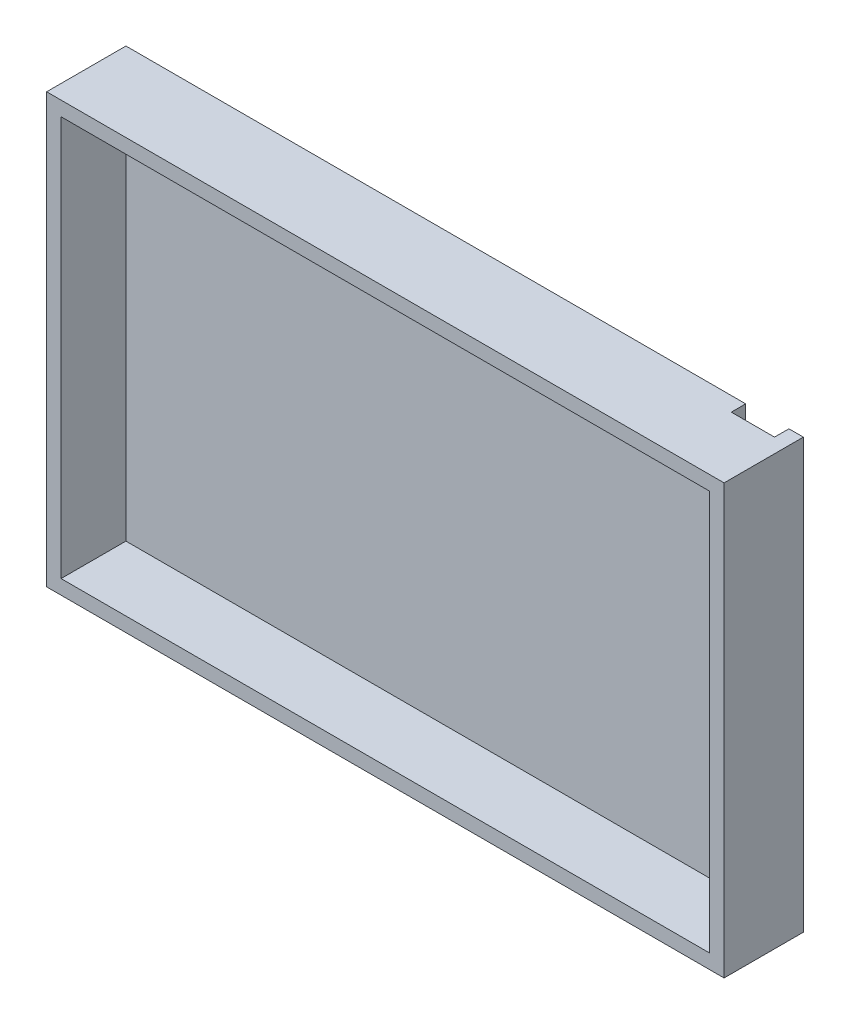
ISO-10303-21;
HEADER;
FILE_DESCRIPTION(('STEP AP214'),'2;1');
FILE_NAME('part.step','',(''),(''),'','','');
FILE_SCHEMA(('AUTOMOTIVE_DESIGN { 1 0 10303 214 1 1 1 1 }'));
ENDSEC;
DATA;
#1=APPLICATION_CONTEXT('core data for automotive mechanical design processes');
#2=APPLICATION_PROTOCOL_DEFINITION('international standard','automotive_design',2000,#1);
#3=PRODUCT_CONTEXT('',#1,'mechanical');
#4=PRODUCT('Part','Part','',(#3));
#5=PRODUCT_RELATED_PRODUCT_CATEGORY('part','',(#4));
#6=PRODUCT_DEFINITION_FORMATION('','',#4);
#7=PRODUCT_DEFINITION_CONTEXT('part definition',#1,'design');
#8=PRODUCT_DEFINITION('design','',#6,#7);
#9=PRODUCT_DEFINITION_SHAPE('','',#8);
#10=(LENGTH_UNIT() NAMED_UNIT(*) SI_UNIT(.MILLI.,.METRE.));
#11=(NAMED_UNIT(*) PLANE_ANGLE_UNIT() SI_UNIT($,.RADIAN.));
#12=(NAMED_UNIT(*) SI_UNIT($,.STERADIAN.) SOLID_ANGLE_UNIT());
#13=UNCERTAINTY_MEASURE_WITH_UNIT(LENGTH_MEASURE(1.E-05),#10,'distance_accuracy_value','');
#14=(GEOMETRIC_REPRESENTATION_CONTEXT(3) GLOBAL_UNCERTAINTY_ASSIGNED_CONTEXT((#13)) GLOBAL_UNIT_ASSIGNED_CONTEXT((#10,
#11,#12)) REPRESENTATION_CONTEXT('',''));
#15=CARTESIAN_POINT('',(0.,0.,0.));
#16=DIRECTION('',(0.,0.,1.));
#17=DIRECTION('',(1.,0.,0.));
#18=AXIS2_PLACEMENT_3D('',#15,#16,#17);
#19=CARTESIAN_POINT('',(0.,0.,2.));
#20=DIRECTION('',(0.,0.,1.));
#21=DIRECTION('',(1.,0.,0.));
#22=AXIS2_PLACEMENT_3D('',#19,#20,#21);
#23=PLANE('',#22);
#24=DIRECTION('',(1.,0.,0.));
#25=VECTOR('',#24,1.);
#26=CARTESIAN_POINT('',(-45.,-27.75,2.));
#27=LINE('',#26,#25);
#28=CARTESIAN_POINT('',(-45.,-27.75,2.));
#29=VERTEX_POINT('',#28);
#30=CARTESIAN_POINT('',(39.,-27.75,2.));
#31=VERTEX_POINT('',#30);
#32=EDGE_CURVE('E183',#29,#31,#27,.T.);
#33=ORIENTED_EDGE('',*,*,#32,.T.);
#34=DIRECTION('',(0.,1.,0.));
#35=VECTOR('',#34,1.);
#36=CARTESIAN_POINT('',(39.,29.75,2.));
#37=LINE('',#36,#35);
#38=CARTESIAN_POINT('',(39.,27.75,2.));
#39=VERTEX_POINT('',#38);
#40=EDGE_CURVE('E171',#31,#39,#37,.T.);
#41=ORIENTED_EDGE('',*,*,#40,.T.);
#42=DIRECTION('',(-1.,0.,0.));
#43=VECTOR('',#42,1.);
#44=CARTESIAN_POINT('',(-45.,27.75,2.));
#45=LINE('',#44,#43);
#46=CARTESIAN_POINT('',(-45.,27.75,2.));
#47=VERTEX_POINT('',#46);
#48=EDGE_CURVE('E179',#39,#47,#45,.T.);
#49=ORIENTED_EDGE('',*,*,#48,.T.);
#50=DIRECTION('',(0.,-1.,0.));
#51=VECTOR('',#50,1.);
#52=CARTESIAN_POINT('',(-45.,27.75,2.));
#53=LINE('',#52,#51);
#54=EDGE_CURVE('E178',#47,#29,#53,.T.);
#55=ORIENTED_EDGE('',*,*,#54,.T.);
#56=EDGE_LOOP('',(#33,#41,#49,#55));
#57=FACE_BOUND('',#56,.T.);
#58=ADVANCED_FACE('F45',(#57),#23,.T.);
#59=CARTESIAN_POINT('',(0.,0.,0.));
#60=DIRECTION('',(0.,0.,1.));
#61=DIRECTION('',(1.,0.,0.));
#62=AXIS2_PLACEMENT_3D('',#59,#60,#61);
#63=PLANE('',#62);
#64=DIRECTION('',(-1.,0.,0.));
#65=VECTOR('',#64,1.);
#66=CARTESIAN_POINT('',(-47.,29.75,0.));
#67=LINE('',#66,#65);
#68=CARTESIAN_POINT('',(39.,29.75,0.));
#69=VERTEX_POINT('',#68);
#70=CARTESIAN_POINT('',(-47.,29.75,0.));
#71=VERTEX_POINT('',#70);
#72=EDGE_CURVE('E233',#69,#71,#67,.T.);
#73=ORIENTED_EDGE('',*,*,#72,.F.);
#74=DIRECTION('',(0.,1.,0.));
#75=VECTOR('',#74,1.);
#76=CARTESIAN_POINT('',(39.,29.75,0.));
#77=LINE('',#76,#75);
#78=CARTESIAN_POINT('',(39.,-29.75,0.));
#79=VERTEX_POINT('',#78);
#80=EDGE_CURVE('E156',#79,#69,#77,.T.);
#81=ORIENTED_EDGE('',*,*,#80,.F.);
#82=DIRECTION('',(1.,0.,0.));
#83=VECTOR('',#82,1.);
#84=CARTESIAN_POINT('',(-47.,-29.75,0.));
#85=LINE('',#84,#83);
#86=CARTESIAN_POINT('',(-47.,-29.75,0.));
#87=VERTEX_POINT('',#86);
#88=EDGE_CURVE('E220',#87,#79,#85,.T.);
#89=ORIENTED_EDGE('',*,*,#88,.F.);
#90=DIRECTION('',(0.,-1.,0.));
#91=VECTOR('',#90,1.);
#92=CARTESIAN_POINT('',(-47.,29.75,0.));
#93=LINE('',#92,#91);
#94=EDGE_CURVE('E236',#71,#87,#93,.T.);
#95=ORIENTED_EDGE('',*,*,#94,.F.);
#96=EDGE_LOOP('',(#73,#81,#89,#95));
#97=FACE_BOUND('',#96,.T.);
#98=ADVANCED_FACE('F260',(#97),#63,.F.);
#99=CARTESIAN_POINT('',(47.,29.75,11.));
#100=DIRECTION('',(-1.,0.,0.));
#101=DIRECTION('',(0.,-1.,0.));
#102=AXIS2_PLACEMENT_3D('',#99,#100,#101);
#103=PLANE('',#102);
#104=DIRECTION('',(0.,1.,0.));
#105=VECTOR('',#104,1.);
#106=CARTESIAN_POINT('',(47.,29.75,0.));
#107=LINE('',#106,#105);
#108=CARTESIAN_POINT('',(47.,-29.75,0.));
#109=VERTEX_POINT('',#108);
#110=CARTESIAN_POINT('',(47.,29.75,0.));
#111=VERTEX_POINT('',#110);
#112=EDGE_CURVE('E206',#109,#111,#107,.T.);
#113=ORIENTED_EDGE('',*,*,#112,.T.);
#114=DIRECTION('',(0.,0.,-1.));
#115=VECTOR('',#114,1.);
#116=CARTESIAN_POINT('',(47.,29.75,11.));
#117=LINE('',#116,#115);
#118=CARTESIAN_POINT('',(47.,29.75,11.));
#119=VERTEX_POINT('',#118);
#120=EDGE_CURVE('E11',#119,#111,#117,.T.);
#121=ORIENTED_EDGE('',*,*,#120,.F.);
#122=DIRECTION('',(0.,1.,0.));
#123=VECTOR('',#122,1.);
#124=CARTESIAN_POINT('',(47.,29.75,11.));
#125=LINE('',#124,#123);
#126=CARTESIAN_POINT('',(47.,-29.75,11.));
#127=VERTEX_POINT('',#126);
#128=EDGE_CURVE('E215',#127,#119,#125,.T.);
#129=ORIENTED_EDGE('',*,*,#128,.F.);
#130=DIRECTION('',(0.,0.,-1.));
#131=VECTOR('',#130,1.);
#132=CARTESIAN_POINT('',(47.,-29.75,11.));
#133=LINE('',#132,#131);
#134=EDGE_CURVE('E229',#127,#109,#133,.T.);
#135=ORIENTED_EDGE('',*,*,#134,.T.);
#136=EDGE_LOOP('',(#113,#121,#129,#135));
#137=FACE_BOUND('',#136,.T.);
#138=ADVANCED_FACE('F47',(#137),#103,.F.);
#139=CARTESIAN_POINT('',(-47.,29.75,11.));
#140=DIRECTION('',(0.,-1.,0.));
#141=DIRECTION('',(0.,0.,-1.));
#142=AXIS2_PLACEMENT_3D('',#139,#140,#141);
#143=PLANE('',#142);
#144=DIRECTION('',(1.,0.,0.));
#145=VECTOR('',#144,1.);
#146=CARTESIAN_POINT('',(45.,29.75,2.));
#147=LINE('',#146,#145);
#148=CARTESIAN_POINT('',(39.,29.75,2.));
#149=VERTEX_POINT('',#148);
#150=CARTESIAN_POINT('',(45.,29.75,2.));
#151=VERTEX_POINT('',#150);
#152=EDGE_CURVE('E151',#149,#151,#147,.T.);
#153=ORIENTED_EDGE('',*,*,#152,.F.);
#154=DIRECTION('',(0.,0.,-1.));
#155=VECTOR('',#154,1.);
#156=CARTESIAN_POINT('',(39.,29.75,2.));
#157=LINE('',#156,#155);
#158=EDGE_CURVE('E285',#149,#69,#157,.T.);
#159=ORIENTED_EDGE('',*,*,#158,.T.);
#160=ORIENTED_EDGE('',*,*,#72,.T.);
#161=DIRECTION('',(0.,0.,-1.));
#162=VECTOR('',#161,1.);
#163=CARTESIAN_POINT('',(-47.,29.75,11.));
#164=LINE('',#163,#162);
#165=CARTESIAN_POINT('',(-47.,29.75,11.));
#166=VERTEX_POINT('',#165);
#167=EDGE_CURVE('E54',#166,#71,#164,.T.);
#168=ORIENTED_EDGE('',*,*,#167,.F.);
#169=DIRECTION('',(-1.,0.,0.));
#170=VECTOR('',#169,1.);
#171=CARTESIAN_POINT('',(-47.,29.75,11.));
#172=LINE('',#171,#170);
#173=EDGE_CURVE('E219',#119,#166,#172,.T.);
#174=ORIENTED_EDGE('',*,*,#173,.F.);
#175=ORIENTED_EDGE('',*,*,#120,.T.);
#176=CARTESIAN_POINT('',(45.,29.75,0.));
#177=VERTEX_POINT('',#176);
#178=EDGE_CURVE('E160',#111,#177,#67,.T.);
#179=ORIENTED_EDGE('',*,*,#178,.T.);
#180=DIRECTION('',(0.,0.,-1.));
#181=VECTOR('',#180,1.);
#182=CARTESIAN_POINT('',(45.,29.75,2.));
#183=LINE('',#182,#181);
#184=EDGE_CURVE('E69',#151,#177,#183,.T.);
#185=ORIENTED_EDGE('',*,*,#184,.F.);
#186=EDGE_LOOP('',(#153,#159,#160,#168,#174,#175,#179,#185));
#187=FACE_BOUND('',#186,.T.);
#188=ADVANCED_FACE('F159',(#187),#143,.F.);
#189=CARTESIAN_POINT('',(-47.,29.75,11.));
#190=DIRECTION('',(1.,0.,0.));
#191=DIRECTION('',(0.,1.,0.));
#192=AXIS2_PLACEMENT_3D('',#189,#190,#191);
#193=PLANE('',#192);
#194=ORIENTED_EDGE('',*,*,#94,.T.);
#195=DIRECTION('',(0.,0.,-1.));
#196=VECTOR('',#195,1.);
#197=CARTESIAN_POINT('',(-47.,-29.75,11.));
#198=LINE('',#197,#196);
#199=CARTESIAN_POINT('',(-47.,-29.75,11.));
#200=VERTEX_POINT('',#199);
#201=EDGE_CURVE('E246',#200,#87,#198,.T.);
#202=ORIENTED_EDGE('',*,*,#201,.F.);
#203=DIRECTION('',(0.,-1.,0.));
#204=VECTOR('',#203,1.);
#205=CARTESIAN_POINT('',(-47.,29.75,11.));
#206=LINE('',#205,#204);
#207=EDGE_CURVE('E223',#166,#200,#206,.T.);
#208=ORIENTED_EDGE('',*,*,#207,.F.);
#209=ORIENTED_EDGE('',*,*,#167,.T.);
#210=EDGE_LOOP('',(#194,#202,#208,#209));
#211=FACE_BOUND('',#210,.T.);
#212=ADVANCED_FACE('F255',(#211),#193,.F.);
#213=CARTESIAN_POINT('',(-47.,-29.75,11.));
#214=DIRECTION('',(0.,1.,0.));
#215=DIRECTION('',(0.,0.,1.));
#216=AXIS2_PLACEMENT_3D('',#213,#214,#215);
#217=PLANE('',#216);
#218=ORIENTED_EDGE('',*,*,#88,.T.);
#219=DIRECTION('',(0.,0.,-1.));
#220=VECTOR('',#219,1.);
#221=CARTESIAN_POINT('',(39.,-29.75,2.));
#222=LINE('',#221,#220);
#223=CARTESIAN_POINT('',(39.,-29.75,2.));
#224=VERTEX_POINT('',#223);
#225=EDGE_CURVE('E168',#224,#79,#222,.T.);
#226=ORIENTED_EDGE('',*,*,#225,.F.);
#227=DIRECTION('',(-1.,0.,0.));
#228=VECTOR('',#227,1.);
#229=CARTESIAN_POINT('',(45.,-29.75,2.));
#230=LINE('',#229,#228);
#231=CARTESIAN_POINT('',(45.,-29.75,2.));
#232=VERTEX_POINT('',#231);
#233=EDGE_CURVE('E147',#232,#224,#230,.T.);
#234=ORIENTED_EDGE('',*,*,#233,.F.);
#235=DIRECTION('',(0.,0.,-1.));
#236=VECTOR('',#235,1.);
#237=CARTESIAN_POINT('',(45.,-29.75,2.));
#238=LINE('',#237,#236);
#239=CARTESIAN_POINT('',(45.,-29.75,0.));
#240=VERTEX_POINT('',#239);
#241=EDGE_CURVE('E162',#232,#240,#238,.T.);
#242=ORIENTED_EDGE('',*,*,#241,.T.);
#243=EDGE_CURVE('E239',#240,#109,#85,.T.);
#244=ORIENTED_EDGE('',*,*,#243,.T.);
#245=ORIENTED_EDGE('',*,*,#134,.F.);
#246=DIRECTION('',(1.,0.,0.));
#247=VECTOR('',#246,1.);
#248=CARTESIAN_POINT('',(-47.,-29.75,11.));
#249=LINE('',#248,#247);
#250=EDGE_CURVE('E226',#200,#127,#249,.T.);
#251=ORIENTED_EDGE('',*,*,#250,.F.);
#252=ORIENTED_EDGE('',*,*,#201,.T.);
#253=EDGE_LOOP('',(#218,#226,#234,#242,#244,#245,#251,#252));
#254=FACE_BOUND('',#253,.T.);
#255=ADVANCED_FACE('F264',(#254),#217,.F.);
#256=CARTESIAN_POINT('',(0.,0.,11.));
#257=DIRECTION('',(0.,0.,1.));
#258=DIRECTION('',(1.,0.,0.));
#259=AXIS2_PLACEMENT_3D('',#256,#257,#258);
#260=PLANE('',#259);
#261=DIRECTION('',(0.,1.,0.));
#262=VECTOR('',#261,1.);
#263=CARTESIAN_POINT('',(45.,27.75,11.));
#264=LINE('',#263,#262);
#265=CARTESIAN_POINT('',(45.,-27.75,11.));
#266=VERTEX_POINT('',#265);
#267=CARTESIAN_POINT('',(45.,27.75,11.));
#268=VERTEX_POINT('',#267);
#269=EDGE_CURVE('E188',#266,#268,#264,.T.);
#270=ORIENTED_EDGE('',*,*,#269,.F.);
#271=DIRECTION('',(1.,0.,0.));
#272=VECTOR('',#271,1.);
#273=CARTESIAN_POINT('',(-45.,-27.75,11.));
#274=LINE('',#273,#272);
#275=CARTESIAN_POINT('',(-45.,-27.75,11.));
#276=VERTEX_POINT('',#275);
#277=EDGE_CURVE('E199',#276,#266,#274,.T.);
#278=ORIENTED_EDGE('',*,*,#277,.F.);
#279=DIRECTION('',(0.,-1.,0.));
#280=VECTOR('',#279,1.);
#281=CARTESIAN_POINT('',(-45.,27.75,11.));
#282=LINE('',#281,#280);
#283=CARTESIAN_POINT('',(-45.,27.75,11.));
#284=VERTEX_POINT('',#283);
#285=EDGE_CURVE('E195',#284,#276,#282,.T.);
#286=ORIENTED_EDGE('',*,*,#285,.F.);
#287=DIRECTION('',(-1.,0.,0.));
#288=VECTOR('',#287,1.);
#289=CARTESIAN_POINT('',(-45.,27.75,11.));
#290=LINE('',#289,#288);
#291=EDGE_CURVE('E191',#268,#284,#290,.T.);
#292=ORIENTED_EDGE('',*,*,#291,.F.);
#293=EDGE_LOOP('',(#270,#278,#286,#292));
#294=FACE_BOUND('',#293,.T.);
#295=ORIENTED_EDGE('',*,*,#128,.T.);
#296=ORIENTED_EDGE('',*,*,#173,.T.);
#297=ORIENTED_EDGE('',*,*,#207,.T.);
#298=ORIENTED_EDGE('',*,*,#250,.T.);
#299=EDGE_LOOP('',(#295,#296,#297,#298));
#300=FACE_BOUND('',#299,.T.);
#301=ADVANCED_FACE('F270',(#294,#300),#260,.T.);
#302=ORIENTED_EDGE('',*,*,#243,.F.);
#303=DIRECTION('',(0.,-1.,0.));
#304=VECTOR('',#303,1.);
#305=CARTESIAN_POINT('',(45.,29.75,0.));
#306=LINE('',#305,#304);
#307=EDGE_CURVE('E277',#177,#240,#306,.T.);
#308=ORIENTED_EDGE('',*,*,#307,.F.);
#309=ORIENTED_EDGE('',*,*,#178,.F.);
#310=ORIENTED_EDGE('',*,*,#112,.F.);
#311=EDGE_LOOP('',(#302,#308,#309,#310));
#312=FACE_BOUND('',#311,.T.);
#313=ADVANCED_FACE('F276',(#312),#63,.F.);
#314=CARTESIAN_POINT('',(45.,27.75,2.));
#315=DIRECTION('',(1.,0.,0.));
#316=DIRECTION('',(0.,0.,-1.));
#317=AXIS2_PLACEMENT_3D('',#314,#315,#316);
#318=PLANE('',#317);
#319=ORIENTED_EDGE('',*,*,#269,.T.);
#320=DIRECTION('',(0.,0.,1.));
#321=VECTOR('',#320,1.);
#322=CARTESIAN_POINT('',(45.,27.75,2.));
#323=LINE('',#322,#321);
#324=CARTESIAN_POINT('',(45.,27.75,2.));
#325=VERTEX_POINT('',#324);
#326=EDGE_CURVE('E143',#325,#268,#323,.T.);
#327=ORIENTED_EDGE('',*,*,#326,.F.);
#328=DIRECTION('',(0.,-1.,0.));
#329=VECTOR('',#328,1.);
#330=CARTESIAN_POINT('',(45.,29.75,2.));
#331=LINE('',#330,#329);
#332=EDGE_CURVE('E139',#151,#325,#331,.T.);
#333=ORIENTED_EDGE('',*,*,#332,.F.);
#334=ORIENTED_EDGE('',*,*,#184,.T.);
#335=ORIENTED_EDGE('',*,*,#307,.T.);
#336=ORIENTED_EDGE('',*,*,#241,.F.);
#337=CARTESIAN_POINT('',(45.,-27.75,2.));
#338=VERTEX_POINT('',#337);
#339=EDGE_CURVE('E148',#338,#232,#331,.T.);
#340=ORIENTED_EDGE('',*,*,#339,.F.);
#341=DIRECTION('',(0.,0.,1.));
#342=VECTOR('',#341,1.);
#343=CARTESIAN_POINT('',(45.,-27.75,2.));
#344=LINE('',#343,#342);
#345=EDGE_CURVE('E203',#338,#266,#344,.T.);
#346=ORIENTED_EDGE('',*,*,#345,.T.);
#347=EDGE_LOOP('',(#319,#327,#333,#334,#335,#336,#340,#346));
#348=FACE_BOUND('',#347,.T.);
#349=ADVANCED_FACE('F141',(#348),#318,.F.);
#350=CARTESIAN_POINT('',(-45.,-27.75,2.));
#351=DIRECTION('',(0.,-1.,0.));
#352=DIRECTION('',(0.,0.,-1.));
#353=AXIS2_PLACEMENT_3D('',#350,#351,#352);
#354=PLANE('',#353);
#355=ORIENTED_EDGE('',*,*,#277,.T.);
#356=ORIENTED_EDGE('',*,*,#345,.F.);
#357=EDGE_CURVE('E187',#31,#338,#27,.T.);
#358=ORIENTED_EDGE('',*,*,#357,.F.);
#359=ORIENTED_EDGE('',*,*,#32,.F.);
#360=DIRECTION('',(0.,0.,1.));
#361=VECTOR('',#360,1.);
#362=CARTESIAN_POINT('',(-45.,-27.75,2.));
#363=LINE('',#362,#361);
#364=EDGE_CURVE('E207',#29,#276,#363,.T.);
#365=ORIENTED_EDGE('',*,*,#364,.T.);
#366=EDGE_LOOP('',(#355,#356,#358,#359,#365));
#367=FACE_BOUND('',#366,.T.);
#368=ADVANCED_FACE('F298',(#367),#354,.F.);
#369=CARTESIAN_POINT('',(-45.,27.75,2.));
#370=DIRECTION('',(-1.,0.,0.));
#371=DIRECTION('',(0.,-1.,0.));
#372=AXIS2_PLACEMENT_3D('',#369,#370,#371);
#373=PLANE('',#372);
#374=ORIENTED_EDGE('',*,*,#285,.T.);
#375=ORIENTED_EDGE('',*,*,#364,.F.);
#376=ORIENTED_EDGE('',*,*,#54,.F.);
#377=DIRECTION('',(0.,0.,1.));
#378=VECTOR('',#377,1.);
#379=CARTESIAN_POINT('',(-45.,27.75,2.));
#380=LINE('',#379,#378);
#381=EDGE_CURVE('E210',#47,#284,#380,.T.);
#382=ORIENTED_EDGE('',*,*,#381,.T.);
#383=EDGE_LOOP('',(#374,#375,#376,#382));
#384=FACE_BOUND('',#383,.T.);
#385=ADVANCED_FACE('F305',(#384),#373,.F.);
#386=CARTESIAN_POINT('',(-45.,27.75,2.));
#387=DIRECTION('',(0.,1.,0.));
#388=DIRECTION('',(0.,0.,1.));
#389=AXIS2_PLACEMENT_3D('',#386,#387,#388);
#390=PLANE('',#389);
#391=ORIENTED_EDGE('',*,*,#291,.T.);
#392=ORIENTED_EDGE('',*,*,#381,.F.);
#393=ORIENTED_EDGE('',*,*,#48,.F.);
#394=EDGE_CURVE('E175',#325,#39,#45,.T.);
#395=ORIENTED_EDGE('',*,*,#394,.F.);
#396=ORIENTED_EDGE('',*,*,#326,.T.);
#397=EDGE_LOOP('',(#391,#392,#393,#395,#396));
#398=FACE_BOUND('',#397,.T.);
#399=ADVANCED_FACE('F312',(#398),#390,.F.);
#400=CARTESIAN_POINT('',(0.,0.,2.));
#401=DIRECTION('',(0.,0.,1.));
#402=DIRECTION('',(1.,0.,0.));
#403=AXIS2_PLACEMENT_3D('',#400,#401,#402);
#404=PLANE('',#403);
#405=ORIENTED_EDGE('',*,*,#394,.T.);
#406=EDGE_CURVE('E61',#39,#149,#37,.T.);
#407=ORIENTED_EDGE('',*,*,#406,.T.);
#408=ORIENTED_EDGE('',*,*,#152,.T.);
#409=ORIENTED_EDGE('',*,*,#332,.T.);
#410=EDGE_LOOP('',(#405,#407,#408,#409));
#411=FACE_BOUND('',#410,.T.);
#412=ADVANCED_FACE('F152',(#411),#404,.F.);
#413=CARTESIAN_POINT('',(39.,29.75,2.));
#414=DIRECTION('',(-1.,0.,0.));
#415=DIRECTION('',(0.,-1.,0.));
#416=AXIS2_PLACEMENT_3D('',#413,#414,#415);
#417=PLANE('',#416);
#418=ORIENTED_EDGE('',*,*,#80,.T.);
#419=ORIENTED_EDGE('',*,*,#158,.F.);
#420=ORIENTED_EDGE('',*,*,#406,.F.);
#421=ORIENTED_EDGE('',*,*,#40,.F.);
#422=EDGE_CURVE('E163',#224,#31,#37,.T.);
#423=ORIENTED_EDGE('',*,*,#422,.F.);
#424=ORIENTED_EDGE('',*,*,#225,.T.);
#425=EDGE_LOOP('',(#418,#419,#420,#421,#423,#424));
#426=FACE_BOUND('',#425,.T.);
#427=ADVANCED_FACE('F289',(#426),#417,.F.);
#428=ORIENTED_EDGE('',*,*,#357,.T.);
#429=ORIENTED_EDGE('',*,*,#339,.T.);
#430=ORIENTED_EDGE('',*,*,#233,.T.);
#431=ORIENTED_EDGE('',*,*,#422,.T.);
#432=EDGE_LOOP('',(#428,#429,#430,#431));
#433=FACE_BOUND('',#432,.T.);
#434=ADVANCED_FACE('F293',(#433),#404,.F.);
#435=CLOSED_SHELL('',(#58,#98,#138,#188,#212,#255,#301,#313,#349,#368,#385,#399,#412,#427,#434));
#436=MANIFOLD_SOLID_BREP('B2',#435);
#437=ADVANCED_BREP_SHAPE_REPRESENTATION('',(#18,#436),#14);
#438=SHAPE_DEFINITION_REPRESENTATION(#9,#437);
ENDSEC;
END-ISO-10303-21;
